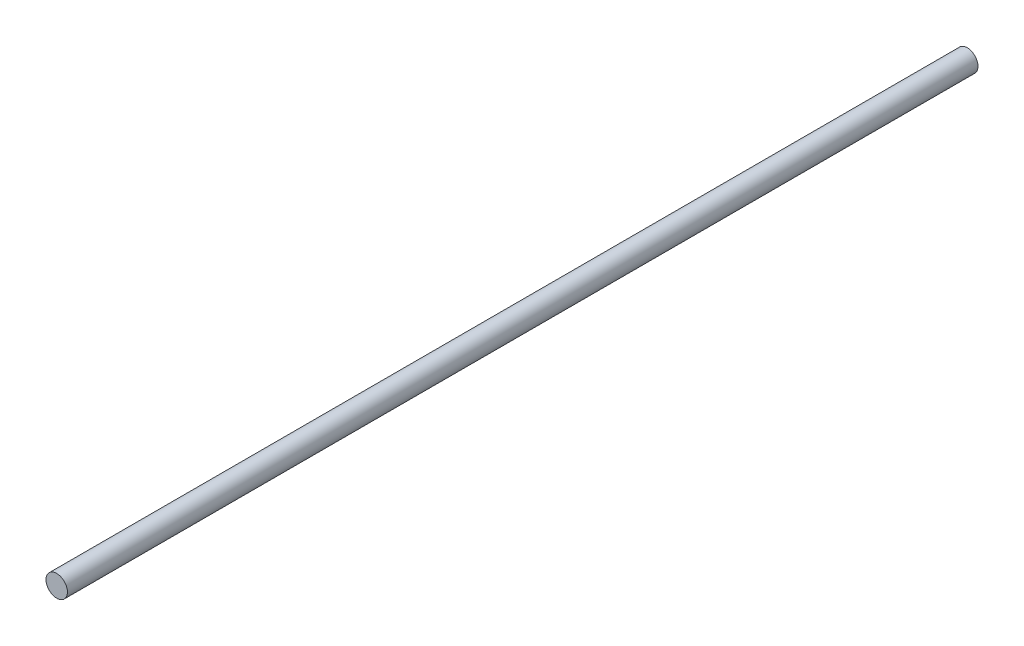
ISO-10303-21;
HEADER;
FILE_DESCRIPTION(('STEP AP214'),'2;1');
FILE_NAME('part.step','',(''),(''),'','','');
FILE_SCHEMA(('AUTOMOTIVE_DESIGN { 1 0 10303 214 1 1 1 1 }'));
ENDSEC;
DATA;
#1=APPLICATION_CONTEXT('core data for automotive mechanical design processes');
#2=APPLICATION_PROTOCOL_DEFINITION('international standard','automotive_design',2000,#1);
#3=PRODUCT_CONTEXT('',#1,'mechanical');
#4=PRODUCT('Part','Part','',(#3));
#5=PRODUCT_RELATED_PRODUCT_CATEGORY('part','',(#4));
#6=PRODUCT_DEFINITION_FORMATION('','',#4);
#7=PRODUCT_DEFINITION_CONTEXT('part definition',#1,'design');
#8=PRODUCT_DEFINITION('design','',#6,#7);
#9=PRODUCT_DEFINITION_SHAPE('','',#8);
#10=(LENGTH_UNIT() NAMED_UNIT(*) SI_UNIT(.MILLI.,.METRE.));
#11=(NAMED_UNIT(*) PLANE_ANGLE_UNIT() SI_UNIT($,.RADIAN.));
#12=(NAMED_UNIT(*) SI_UNIT($,.STERADIAN.) SOLID_ANGLE_UNIT());
#13=UNCERTAINTY_MEASURE_WITH_UNIT(LENGTH_MEASURE(1.E-05),#10,'distance_accuracy_value','');
#14=(GEOMETRIC_REPRESENTATION_CONTEXT(3) GLOBAL_UNCERTAINTY_ASSIGNED_CONTEXT((#13)) GLOBAL_UNIT_ASSIGNED_CONTEXT((#10,
#11,#12)) REPRESENTATION_CONTEXT('',''));
#15=CARTESIAN_POINT('',(0.,0.,0.));
#16=DIRECTION('',(0.,0.,1.));
#17=DIRECTION('',(1.,0.,0.));
#18=AXIS2_PLACEMENT_3D('',#15,#16,#17);
#19=CARTESIAN_POINT('',(0.,0.,88.9));
#20=DIRECTION('',(0.,0.,-1.));
#21=DIRECTION('',(-1.,0.,0.));
#22=AXIS2_PLACEMENT_3D('',#19,#20,#21);
#23=CYLINDRICAL_SURFACE('',#22,2.0955);
#24=CARTESIAN_POINT('',(0.,0.,88.9));
#25=DIRECTION('',(0.,0.,1.));
#26=DIRECTION('',(1.,0.,0.));
#27=AXIS2_PLACEMENT_3D('',#24,#25,#26);
#28=CIRCLE('',#27,2.0955);
#29=CARTESIAN_POINT('',(2.0955,0.,88.9));
#30=VERTEX_POINT('',#29);
#31=EDGE_CURVE('E10',#30,#30,#28,.T.);
#32=ORIENTED_EDGE('',*,*,#31,.F.);
#33=EDGE_LOOP('',(#32));
#34=FACE_BOUND('',#33,.T.);
#35=CARTESIAN_POINT('',(0.,0.,-88.9));
#36=DIRECTION('',(0.,0.,1.));
#37=DIRECTION('',(1.,0.,0.));
#38=AXIS2_PLACEMENT_3D('',#35,#36,#37);
#39=CIRCLE('',#38,2.0955);
#40=CARTESIAN_POINT('',(2.0955,0.,-88.9));
#41=VERTEX_POINT('',#40);
#42=EDGE_CURVE('E32',#41,#41,#39,.T.);
#43=ORIENTED_EDGE('',*,*,#42,.T.);
#44=EDGE_LOOP('',(#43));
#45=FACE_BOUND('',#44,.T.);
#46=ADVANCED_FACE('F29',(#34,#45),#23,.T.);
#47=CARTESIAN_POINT('',(0.,0.,88.9));
#48=DIRECTION('',(0.,0.,1.));
#49=DIRECTION('',(1.,0.,0.));
#50=AXIS2_PLACEMENT_3D('',#47,#48,#49);
#51=PLANE('',#50);
#52=ORIENTED_EDGE('',*,*,#31,.T.);
#53=EDGE_LOOP('',(#52));
#54=FACE_BOUND('',#53,.T.);
#55=ADVANCED_FACE('F44',(#54),#51,.T.);
#56=CARTESIAN_POINT('',(0.,0.,-88.9));
#57=DIRECTION('',(0.,0.,1.));
#58=DIRECTION('',(1.,0.,0.));
#59=AXIS2_PLACEMENT_3D('',#56,#57,#58);
#60=PLANE('',#59);
#61=ORIENTED_EDGE('',*,*,#42,.F.);
#62=EDGE_LOOP('',(#61));
#63=FACE_BOUND('',#62,.T.);
#64=ADVANCED_FACE('F42',(#63),#60,.F.);
#65=CLOSED_SHELL('',(#46,#55,#64));
#66=MANIFOLD_SOLID_BREP('B2',#65);
#67=ADVANCED_BREP_SHAPE_REPRESENTATION('',(#18,#66),#14);
#68=SHAPE_DEFINITION_REPRESENTATION(#9,#67);
ENDSEC;
END-ISO-10303-21;
